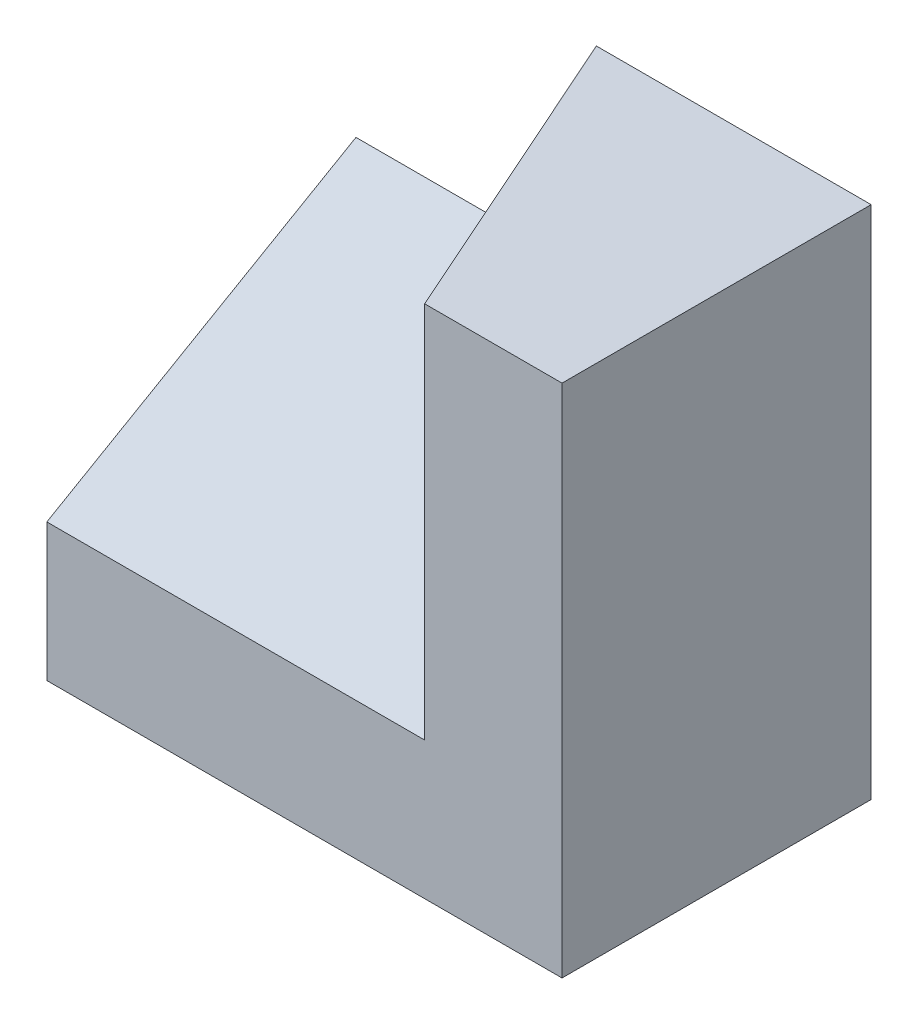
ISO-10303-21;
HEADER;
FILE_DESCRIPTION(('STEP AP214'),'2;1');
FILE_NAME('part.step','',(''),(''),'','','');
FILE_SCHEMA(('AUTOMOTIVE_DESIGN { 1 0 10303 214 1 1 1 1 }'));
ENDSEC;
DATA;
#1=APPLICATION_CONTEXT('core data for automotive mechanical design processes');
#2=APPLICATION_PROTOCOL_DEFINITION('international standard','automotive_design',2000,#1);
#3=PRODUCT_CONTEXT('',#1,'mechanical');
#4=PRODUCT('Part','Part','',(#3));
#5=PRODUCT_RELATED_PRODUCT_CATEGORY('part','',(#4));
#6=PRODUCT_DEFINITION_FORMATION('','',#4);
#7=PRODUCT_DEFINITION_CONTEXT('part definition',#1,'design');
#8=PRODUCT_DEFINITION('design','',#6,#7);
#9=PRODUCT_DEFINITION_SHAPE('','',#8);
#10=(LENGTH_UNIT() NAMED_UNIT(*) SI_UNIT(.MILLI.,.METRE.));
#11=(NAMED_UNIT(*) PLANE_ANGLE_UNIT() SI_UNIT($,.RADIAN.));
#12=(NAMED_UNIT(*) SI_UNIT($,.STERADIAN.) SOLID_ANGLE_UNIT());
#13=UNCERTAINTY_MEASURE_WITH_UNIT(LENGTH_MEASURE(1.E-05),#10,'distance_accuracy_value','');
#14=(GEOMETRIC_REPRESENTATION_CONTEXT(3) GLOBAL_UNCERTAINTY_ASSIGNED_CONTEXT((#13)) GLOBAL_UNIT_ASSIGNED_CONTEXT((#10,
#11,#12)) REPRESENTATION_CONTEXT('',''));
#15=CARTESIAN_POINT('',(0.,0.,0.));
#16=DIRECTION('',(0.,0.,1.));
#17=DIRECTION('',(1.,0.,0.));
#18=AXIS2_PLACEMENT_3D('',#15,#16,#17);
#19=CARTESIAN_POINT('',(-40.,75.,0.));
#20=DIRECTION('',(0.,0.,1.));
#21=DIRECTION('',(1.,0.,0.));
#22=AXIS2_PLACEMENT_3D('',#19,#20,#21);
#23=PLANE('',#22);
#24=DIRECTION('',(0.,-1.,0.));
#25=VECTOR('',#24,1.);
#26=CARTESIAN_POINT('',(0.,75.,0.));
#27=LINE('',#26,#25);
#28=CARTESIAN_POINT('',(0.,75.,0.));
#29=VERTEX_POINT('',#28);
#30=CARTESIAN_POINT('',(0.,0.,0.));
#31=VERTEX_POINT('',#30);
#32=EDGE_CURVE('E126',#29,#31,#27,.T.);
#33=ORIENTED_EDGE('',*,*,#32,.T.);
#34=DIRECTION('',(-1.,0.,0.));
#35=VECTOR('',#34,1.);
#36=CARTESIAN_POINT('',(-40.,0.,0.));
#37=LINE('',#36,#35);
#38=CARTESIAN_POINT('',(-75.,0.,0.));
#39=VERTEX_POINT('',#38);
#40=EDGE_CURVE('E113',#31,#39,#37,.T.);
#41=ORIENTED_EDGE('',*,*,#40,.T.);
#42=DIRECTION('',(0.,1.,0.));
#43=VECTOR('',#42,1.);
#44=CARTESIAN_POINT('',(-75.,0.,0.));
#45=LINE('',#44,#43);
#46=CARTESIAN_POINT('',(-75.,45.9807621135328,0.));
#47=VERTEX_POINT('',#46);
#48=EDGE_CURVE('E92',#39,#47,#45,.T.);
#49=ORIENTED_EDGE('',*,*,#48,.T.);
#50=DIRECTION('',(1.,0.,0.));
#51=VECTOR('',#50,1.);
#52=CARTESIAN_POINT('',(-75.,45.9807621135328,0.));
#53=LINE('',#52,#51);
#54=CARTESIAN_POINT('',(-40.,45.9807621135328,0.));
#55=VERTEX_POINT('',#54);
#56=EDGE_CURVE('E91',#47,#55,#53,.T.);
#57=ORIENTED_EDGE('',*,*,#56,.T.);
#58=DIRECTION('',(0.,-1.,0.));
#59=VECTOR('',#58,1.);
#60=CARTESIAN_POINT('',(-40.,75.,0.));
#61=LINE('',#60,#59);
#62=CARTESIAN_POINT('',(-40.,75.,0.));
#63=VERTEX_POINT('',#62);
#64=EDGE_CURVE('E11',#63,#55,#61,.T.);
#65=ORIENTED_EDGE('',*,*,#64,.F.);
#66=DIRECTION('',(-1.,0.,0.));
#67=VECTOR('',#66,1.);
#68=CARTESIAN_POINT('',(-40.,75.,0.));
#69=LINE('',#68,#67);
#70=EDGE_CURVE('E120',#29,#63,#69,.T.);
#71=ORIENTED_EDGE('',*,*,#70,.F.);
#72=EDGE_LOOP('',(#33,#41,#49,#57,#65,#71));
#73=FACE_BOUND('',#72,.T.);
#74=ADVANCED_FACE('F30',(#73),#23,.F.);
#75=CARTESIAN_POINT('',(-20.,75.,45.));
#76=DIRECTION('',(0.913811548620257,0.,-0.406138466053448));
#77=DIRECTION('',(-0.406138466053448,0.,-0.913811548620257));
#78=AXIS2_PLACEMENT_3D('',#75,#76,#77);
#79=PLANE('',#78);
#80=ORIENTED_EDGE('',*,*,#64,.T.);
#81=DIRECTION('',(0.359210604053551,-0.466628262628686,0.808223859120489));
#82=VECTOR('',#81,1.);
#83=CARTESIAN_POINT('',(-29.218980104802,31.9758064516126,24.2572947641955));
#84=LINE('',#83,#82);
#85=CARTESIAN_POINT('',(-20.,20.,45.));
#86=VERTEX_POINT('',#85);
#87=EDGE_CURVE('E110',#55,#86,#84,.T.);
#88=ORIENTED_EDGE('',*,*,#87,.T.);
#89=DIRECTION('',(0.,-1.,0.));
#90=VECTOR('',#89,1.);
#91=CARTESIAN_POINT('',(-20.,75.,45.));
#92=LINE('',#91,#90);
#93=CARTESIAN_POINT('',(-20.,75.,45.));
#94=VERTEX_POINT('',#93);
#95=EDGE_CURVE('E37',#94,#86,#92,.T.);
#96=ORIENTED_EDGE('',*,*,#95,.F.);
#97=DIRECTION('',(0.406138466053448,0.,0.913811548620257));
#98=VECTOR('',#97,1.);
#99=CARTESIAN_POINT('',(-20.,75.,45.));
#100=LINE('',#99,#98);
#101=EDGE_CURVE('E122',#63,#94,#100,.T.);
#102=ORIENTED_EDGE('',*,*,#101,.F.);
#103=EDGE_LOOP('',(#80,#88,#96,#102));
#104=FACE_BOUND('',#103,.T.);
#105=ADVANCED_FACE('F140',(#104),#79,.F.);
#106=CARTESIAN_POINT('',(0.,75.,45.));
#107=DIRECTION('',(0.,0.,-1.));
#108=DIRECTION('',(-1.,0.,0.));
#109=AXIS2_PLACEMENT_3D('',#106,#107,#108);
#110=PLANE('',#109);
#111=ORIENTED_EDGE('',*,*,#95,.T.);
#112=DIRECTION('',(1.,0.,0.));
#113=VECTOR('',#112,1.);
#114=CARTESIAN_POINT('',(-75.,20.,45.));
#115=LINE('',#114,#113);
#116=CARTESIAN_POINT('',(-75.,20.,45.));
#117=VERTEX_POINT('',#116);
#118=EDGE_CURVE('E82',#117,#86,#115,.T.);
#119=ORIENTED_EDGE('',*,*,#118,.F.);
#120=DIRECTION('',(0.,-1.,0.));
#121=VECTOR('',#120,1.);
#122=CARTESIAN_POINT('',(-75.,20.,45.));
#123=LINE('',#122,#121);
#124=CARTESIAN_POINT('',(-75.,0.,45.));
#125=VERTEX_POINT('',#124);
#126=EDGE_CURVE('E86',#117,#125,#123,.T.);
#127=ORIENTED_EDGE('',*,*,#126,.T.);
#128=DIRECTION('',(1.,0.,0.));
#129=VECTOR('',#128,1.);
#130=CARTESIAN_POINT('',(0.,0.,45.));
#131=LINE('',#130,#129);
#132=CARTESIAN_POINT('',(0.,0.,45.));
#133=VERTEX_POINT('',#132);
#134=EDGE_CURVE('E115',#125,#133,#131,.T.);
#135=ORIENTED_EDGE('',*,*,#134,.T.);
#136=DIRECTION('',(0.,-1.,0.));
#137=VECTOR('',#136,1.);
#138=CARTESIAN_POINT('',(0.,75.,45.));
#139=LINE('',#138,#137);
#140=CARTESIAN_POINT('',(0.,75.,45.));
#141=VERTEX_POINT('',#140);
#142=EDGE_CURVE('E128',#141,#133,#139,.T.);
#143=ORIENTED_EDGE('',*,*,#142,.F.);
#144=DIRECTION('',(1.,0.,0.));
#145=VECTOR('',#144,1.);
#146=CARTESIAN_POINT('',(0.,75.,45.));
#147=LINE('',#146,#145);
#148=EDGE_CURVE('E49',#94,#141,#147,.T.);
#149=ORIENTED_EDGE('',*,*,#148,.F.);
#150=EDGE_LOOP('',(#111,#119,#127,#135,#143,#149));
#151=FACE_BOUND('',#150,.T.);
#152=ADVANCED_FACE('F84',(#151),#110,.F.);
#153=CARTESIAN_POINT('',(0.,75.,0.));
#154=DIRECTION('',(-1.,0.,0.));
#155=DIRECTION('',(0.,0.,1.));
#156=AXIS2_PLACEMENT_3D('',#153,#154,#155);
#157=PLANE('',#156);
#158=ORIENTED_EDGE('',*,*,#142,.T.);
#159=DIRECTION('',(0.,0.,-1.));
#160=VECTOR('',#159,1.);
#161=CARTESIAN_POINT('',(0.,0.,0.));
#162=LINE('',#161,#160);
#163=EDGE_CURVE('E117',#133,#31,#162,.T.);
#164=ORIENTED_EDGE('',*,*,#163,.T.);
#165=ORIENTED_EDGE('',*,*,#32,.F.);
#166=DIRECTION('',(0.,0.,-1.));
#167=VECTOR('',#166,1.);
#168=CARTESIAN_POINT('',(0.,75.,0.));
#169=LINE('',#168,#167);
#170=EDGE_CURVE('E44',#141,#29,#169,.T.);
#171=ORIENTED_EDGE('',*,*,#170,.F.);
#172=EDGE_LOOP('',(#158,#164,#165,#171));
#173=FACE_BOUND('',#172,.T.);
#174=ADVANCED_FACE('F130',(#173),#157,.F.);
#175=CARTESIAN_POINT('',(0.,75.,0.));
#176=DIRECTION('',(0.,-1.,0.));
#177=DIRECTION('',(0.,0.,-1.));
#178=AXIS2_PLACEMENT_3D('',#175,#176,#177);
#179=PLANE('',#178);
#180=ORIENTED_EDGE('',*,*,#70,.T.);
#181=ORIENTED_EDGE('',*,*,#101,.T.);
#182=ORIENTED_EDGE('',*,*,#148,.T.);
#183=ORIENTED_EDGE('',*,*,#170,.T.);
#184=EDGE_LOOP('',(#180,#181,#182,#183));
#185=FACE_BOUND('',#184,.T.);
#186=ADVANCED_FACE('F138',(#185),#179,.F.);
#187=CARTESIAN_POINT('',(0.,0.,0.));
#188=DIRECTION('',(0.,-1.,0.));
#189=DIRECTION('',(0.,0.,-1.));
#190=AXIS2_PLACEMENT_3D('',#187,#188,#189);
#191=PLANE('',#190);
#192=ORIENTED_EDGE('',*,*,#40,.F.);
#193=ORIENTED_EDGE('',*,*,#163,.F.);
#194=ORIENTED_EDGE('',*,*,#134,.F.);
#195=DIRECTION('',(0.,0.,-1.));
#196=VECTOR('',#195,1.);
#197=CARTESIAN_POINT('',(-75.,0.,45.));
#198=LINE('',#197,#196);
#199=EDGE_CURVE('E102',#125,#39,#198,.T.);
#200=ORIENTED_EDGE('',*,*,#199,.T.);
#201=EDGE_LOOP('',(#192,#193,#194,#200));
#202=FACE_BOUND('',#201,.T.);
#203=ADVANCED_FACE('F134',(#202),#191,.T.);
#204=CARTESIAN_POINT('',(-75.,45.9807621135328,0.));
#205=DIRECTION('',(0.,0.866025403784442,0.499999999999995));
#206=DIRECTION('',(0.,-0.499999999999995,0.866025403784442));
#207=AXIS2_PLACEMENT_3D('',#204,#205,#206);
#208=PLANE('',#207);
#209=ORIENTED_EDGE('',*,*,#87,.F.);
#210=ORIENTED_EDGE('',*,*,#56,.F.);
#211=DIRECTION('',(0.,-0.499999999999995,0.866025403784442));
#212=VECTOR('',#211,1.);
#213=CARTESIAN_POINT('',(-75.,45.9807621135328,0.));
#214=LINE('',#213,#212);
#215=EDGE_CURVE('E99',#47,#117,#214,.T.);
#216=ORIENTED_EDGE('',*,*,#215,.T.);
#217=ORIENTED_EDGE('',*,*,#118,.T.);
#218=EDGE_LOOP('',(#209,#210,#216,#217));
#219=FACE_BOUND('',#218,.T.);
#220=ADVANCED_FACE('F104',(#219),#208,.T.);
#221=CARTESIAN_POINT('',(-75.,20.,45.));
#222=DIRECTION('',(1.,0.,0.));
#223=DIRECTION('',(0.,0.,-1.));
#224=AXIS2_PLACEMENT_3D('',#221,#222,#223);
#225=PLANE('',#224);
#226=ORIENTED_EDGE('',*,*,#215,.F.);
#227=ORIENTED_EDGE('',*,*,#48,.F.);
#228=ORIENTED_EDGE('',*,*,#199,.F.);
#229=ORIENTED_EDGE('',*,*,#126,.F.);
#230=EDGE_LOOP('',(#226,#227,#228,#229));
#231=FACE_BOUND('',#230,.T.);
#232=ADVANCED_FACE('F97',(#231),#225,.F.);
#233=CLOSED_SHELL('',(#74,#105,#152,#174,#186,#203,#220,#232));
#234=MANIFOLD_SOLID_BREP('B2',#233);
#235=ADVANCED_BREP_SHAPE_REPRESENTATION('',(#18,#234),#14);
#236=SHAPE_DEFINITION_REPRESENTATION(#9,#235);
ENDSEC;
END-ISO-10303-21;
